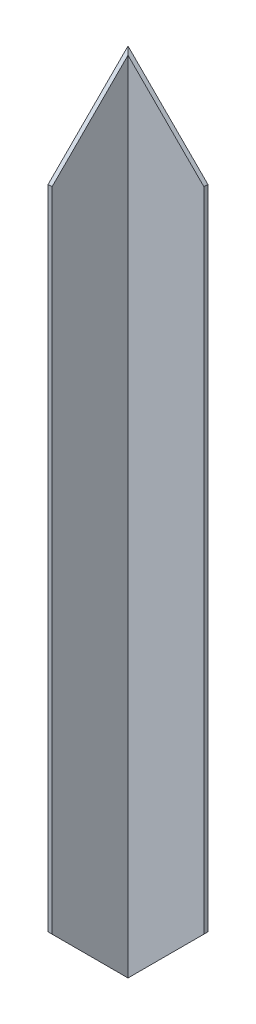
ISO-10303-21;
HEADER;
FILE_DESCRIPTION(('STEP AP214'),'2;1');
FILE_NAME('part.step','',(''),(''),'','','');
FILE_SCHEMA(('AUTOMOTIVE_DESIGN { 1 0 10303 214 1 1 1 1 }'));
ENDSEC;
DATA;
#1=APPLICATION_CONTEXT('core data for automotive mechanical design processes');
#2=APPLICATION_PROTOCOL_DEFINITION('international standard','automotive_design',2000,#1);
#3=PRODUCT_CONTEXT('',#1,'mechanical');
#4=PRODUCT('Part','Part','',(#3));
#5=PRODUCT_RELATED_PRODUCT_CATEGORY('part','',(#4));
#6=PRODUCT_DEFINITION_FORMATION('','',#4);
#7=PRODUCT_DEFINITION_CONTEXT('part definition',#1,'design');
#8=PRODUCT_DEFINITION('design','',#6,#7);
#9=PRODUCT_DEFINITION_SHAPE('','',#8);
#10=(LENGTH_UNIT() NAMED_UNIT(*) SI_UNIT(.MILLI.,.METRE.));
#11=(NAMED_UNIT(*) PLANE_ANGLE_UNIT() SI_UNIT($,.RADIAN.));
#12=(NAMED_UNIT(*) SI_UNIT($,.STERADIAN.) SOLID_ANGLE_UNIT());
#13=UNCERTAINTY_MEASURE_WITH_UNIT(LENGTH_MEASURE(1.E-05),#10,'distance_accuracy_value','');
#14=(GEOMETRIC_REPRESENTATION_CONTEXT(3) GLOBAL_UNCERTAINTY_ASSIGNED_CONTEXT((#13)) GLOBAL_UNIT_ASSIGNED_CONTEXT((#10,
#11,#12)) REPRESENTATION_CONTEXT('',''));
#15=CARTESIAN_POINT('',(0.,0.,0.));
#16=DIRECTION('',(0.,0.,1.));
#17=DIRECTION('',(1.,0.,0.));
#18=AXIS2_PLACEMENT_3D('',#15,#16,#17);
#19=CARTESIAN_POINT('',(-20.,404.,-20.1136363636364));
#20=DIRECTION('',(1.,0.,0.));
#21=DIRECTION('',(0.,0.,-1.));
#22=AXIS2_PLACEMENT_3D('',#19,#20,#21);
#23=PLANE('',#22);
#24=DIRECTION('',(0.,-1.,0.));
#25=VECTOR('',#24,1.);
#26=CARTESIAN_POINT('',(-20.,404.,19.8863636363636));
#27=LINE('',#26,#25);
#28=CARTESIAN_POINT('',(-20.,364.000000000001,19.8863636363636));
#29=VERTEX_POINT('',#28);
#30=CARTESIAN_POINT('',(-20.,39.9999999999995,19.8863636363636));
#31=VERTEX_POINT('',#30);
#32=EDGE_CURVE('E110',#29,#31,#27,.T.);
#33=ORIENTED_EDGE('',*,*,#32,.F.);
#34=DIRECTION('',(0.,-0.707106781186543,0.707106781186552));
#35=VECTOR('',#34,1.);
#36=CARTESIAN_POINT('',(-20.,404.,-20.1136363636364));
#37=LINE('',#36,#35);
#38=CARTESIAN_POINT('',(-20.,404.,-20.1136363636364));
#39=VERTEX_POINT('',#38);
#40=EDGE_CURVE('E128',#39,#29,#37,.T.);
#41=ORIENTED_EDGE('',*,*,#40,.F.);
#42=DIRECTION('',(0.,-1.,0.));
#43=VECTOR('',#42,1.);
#44=CARTESIAN_POINT('',(-20.,404.,-20.1136363636364));
#45=LINE('',#44,#43);
#46=CARTESIAN_POINT('',(-20.,0.,-20.1136363636364));
#47=VERTEX_POINT('',#46);
#48=EDGE_CURVE('E96',#39,#47,#45,.T.);
#49=ORIENTED_EDGE('',*,*,#48,.T.);
#50=DIRECTION('',(0.,-0.707106781186543,-0.707106781186552));
#51=VECTOR('',#50,1.);
#52=CARTESIAN_POINT('',(-20.,0.,-20.1136363636364));
#53=LINE('',#52,#51);
#54=EDGE_CURVE('E127',#31,#47,#53,.T.);
#55=ORIENTED_EDGE('',*,*,#54,.F.);
#56=EDGE_LOOP('',(#33,#41,#49,#55));
#57=FACE_BOUND('',#56,.T.);
#58=ADVANCED_FACE('F33',(#57),#23,.F.);
#59=CARTESIAN_POINT('',(-20.,404.,19.8863636363636));
#60=DIRECTION('',(0.,0.,-1.));
#61=DIRECTION('',(-1.,0.,0.));
#62=AXIS2_PLACEMENT_3D('',#59,#60,#61);
#63=PLANE('',#62);
#64=DIRECTION('',(0.,-1.,0.));
#65=VECTOR('',#64,1.);
#66=CARTESIAN_POINT('',(-18.,404.,19.8863636363636));
#67=LINE('',#66,#65);
#68=CARTESIAN_POINT('',(-18.,364.000000000001,19.8863636363636));
#69=VERTEX_POINT('',#68);
#70=CARTESIAN_POINT('',(-18.,39.9999999999995,19.8863636363636));
#71=VERTEX_POINT('',#70);
#72=EDGE_CURVE('E108',#69,#71,#67,.T.);
#73=ORIENTED_EDGE('',*,*,#72,.F.);
#74=DIRECTION('',(-1.,0.,0.));
#75=VECTOR('',#74,1.);
#76=CARTESIAN_POINT('',(20.,364.000000000001,19.8863636363636));
#77=LINE('',#76,#75);
#78=EDGE_CURVE('E131',#69,#29,#77,.T.);
#79=ORIENTED_EDGE('',*,*,#78,.T.);
#80=ORIENTED_EDGE('',*,*,#32,.T.);
#81=DIRECTION('',(-1.,0.,0.));
#82=VECTOR('',#81,1.);
#83=CARTESIAN_POINT('',(570.,39.9999999999995,19.8863636363635));
#84=LINE('',#83,#82);
#85=EDGE_CURVE('E140',#71,#31,#84,.T.);
#86=ORIENTED_EDGE('',*,*,#85,.F.);
#87=EDGE_LOOP('',(#73,#79,#80,#86));
#88=FACE_BOUND('',#87,.T.);
#89=ADVANCED_FACE('F154',(#88),#63,.F.);
#90=CARTESIAN_POINT('',(-18.,404.,-18.1136363636364));
#91=DIRECTION('',(-1.,0.,0.));
#92=DIRECTION('',(0.,0.,1.));
#93=AXIS2_PLACEMENT_3D('',#90,#91,#92);
#94=PLANE('',#93);
#95=DIRECTION('',(0.,-1.,0.));
#96=VECTOR('',#95,1.);
#97=CARTESIAN_POINT('',(-18.,404.,-18.1136363636364));
#98=LINE('',#97,#96);
#99=CARTESIAN_POINT('',(-18.,402.,-18.1136363636364));
#100=VERTEX_POINT('',#99);
#101=CARTESIAN_POINT('',(-18.,1.99999999999996,-18.1136363636363));
#102=VERTEX_POINT('',#101);
#103=EDGE_CURVE('E101',#100,#102,#98,.T.);
#104=ORIENTED_EDGE('',*,*,#103,.F.);
#105=DIRECTION('',(0.,-0.707106781186543,0.707106781186552));
#106=VECTOR('',#105,1.);
#107=CARTESIAN_POINT('',(-18.,403.,-19.1136363636363));
#108=LINE('',#107,#106);
#109=EDGE_CURVE('E133',#100,#69,#108,.T.);
#110=ORIENTED_EDGE('',*,*,#109,.T.);
#111=ORIENTED_EDGE('',*,*,#72,.T.);
#112=DIRECTION('',(0.,-0.707106781186543,-0.707106781186552));
#113=VECTOR('',#112,1.);
#114=CARTESIAN_POINT('',(-18.,202.999999999998,182.886363636364));
#115=LINE('',#114,#113);
#116=EDGE_CURVE('E121',#71,#102,#115,.T.);
#117=ORIENTED_EDGE('',*,*,#116,.T.);
#118=EDGE_LOOP('',(#104,#110,#111,#117));
#119=FACE_BOUND('',#118,.T.);
#120=ADVANCED_FACE('F149',(#119),#94,.F.);
#121=CARTESIAN_POINT('',(-18.,404.,-18.1136363636364));
#122=DIRECTION('',(0.,0.,-1.));
#123=DIRECTION('',(-1.,0.,0.));
#124=AXIS2_PLACEMENT_3D('',#121,#122,#123);
#125=PLANE('',#124);
#126=DIRECTION('',(0.,-1.,0.));
#127=VECTOR('',#126,1.);
#128=CARTESIAN_POINT('',(20.,404.,-18.1136363636364));
#129=LINE('',#128,#127);
#130=CARTESIAN_POINT('',(20.,364.,-18.1136363636364));
#131=VERTEX_POINT('',#130);
#132=CARTESIAN_POINT('',(20.,40.0000000000001,-18.1136363636364));
#133=VERTEX_POINT('',#132);
#134=EDGE_CURVE('E47',#131,#133,#129,.T.);
#135=ORIENTED_EDGE('',*,*,#134,.F.);
#136=DIRECTION('',(-0.707106781186551,0.707106781186544,0.));
#137=VECTOR('',#136,1.);
#138=CARTESIAN_POINT('',(-19.,403.,-18.1136363636364));
#139=LINE('',#138,#137);
#140=EDGE_CURVE('E91',#131,#100,#139,.T.);
#141=ORIENTED_EDGE('',*,*,#140,.T.);
#142=ORIENTED_EDGE('',*,*,#103,.T.);
#143=DIRECTION('',(0.707106781186547,0.707106781186549,0.));
#144=VECTOR('',#143,1.);
#145=CARTESIAN_POINT('',(183.,203.000000000001,-18.1136363636364));
#146=LINE('',#145,#144);
#147=EDGE_CURVE('E103',#102,#133,#146,.T.);
#148=ORIENTED_EDGE('',*,*,#147,.T.);
#149=EDGE_LOOP('',(#135,#141,#142,#148));
#150=FACE_BOUND('',#149,.T.);
#151=ADVANCED_FACE('F145',(#150),#125,.F.);
#152=CARTESIAN_POINT('',(20.,404.,-20.1136363636364));
#153=DIRECTION('',(-1.,0.,0.));
#154=DIRECTION('',(0.,0.,1.));
#155=AXIS2_PLACEMENT_3D('',#152,#153,#154);
#156=PLANE('',#155);
#157=DIRECTION('',(0.,-1.,0.));
#158=VECTOR('',#157,1.);
#159=CARTESIAN_POINT('',(20.,404.,-20.1136363636364));
#160=LINE('',#159,#158);
#161=CARTESIAN_POINT('',(20.,364.,-20.1136363636364));
#162=VERTEX_POINT('',#161);
#163=CARTESIAN_POINT('',(20.,40.0000000000001,-20.1136363636364));
#164=VERTEX_POINT('',#163);
#165=EDGE_CURVE('E55',#162,#164,#160,.T.);
#166=ORIENTED_EDGE('',*,*,#165,.F.);
#167=DIRECTION('',(0.,0.,-1.));
#168=VECTOR('',#167,1.);
#169=CARTESIAN_POINT('',(20.,364.,19.8863636363636));
#170=LINE('',#169,#168);
#171=EDGE_CURVE('E87',#131,#162,#170,.T.);
#172=ORIENTED_EDGE('',*,*,#171,.F.);
#173=ORIENTED_EDGE('',*,*,#134,.T.);
#174=DIRECTION('',(0.,0.,-1.));
#175=VECTOR('',#174,1.);
#176=CARTESIAN_POINT('',(20.,40.0000000000001,569.886363636364));
#177=LINE('',#176,#175);
#178=EDGE_CURVE('E99',#133,#164,#177,.T.);
#179=ORIENTED_EDGE('',*,*,#178,.T.);
#180=EDGE_LOOP('',(#166,#172,#173,#179));
#181=FACE_BOUND('',#180,.T.);
#182=ADVANCED_FACE('F98',(#181),#156,.F.);
#183=CARTESIAN_POINT('',(-20.,404.,-20.1136363636364));
#184=DIRECTION('',(0.,0.,1.));
#185=DIRECTION('',(1.,0.,0.));
#186=AXIS2_PLACEMENT_3D('',#183,#184,#185);
#187=PLANE('',#186);
#188=ORIENTED_EDGE('',*,*,#48,.F.);
#189=DIRECTION('',(-0.707106781186551,0.707106781186544,0.));
#190=VECTOR('',#189,1.);
#191=CARTESIAN_POINT('',(-20.,404.,-20.1136363636364));
#192=LINE('',#191,#190);
#193=EDGE_CURVE('E89',#162,#39,#192,.T.);
#194=ORIENTED_EDGE('',*,*,#193,.F.);
#195=ORIENTED_EDGE('',*,*,#165,.T.);
#196=DIRECTION('',(0.707106781186546,0.707106781186548,0.));
#197=VECTOR('',#196,1.);
#198=CARTESIAN_POINT('',(-20.,0.,-20.1136363636364));
#199=LINE('',#198,#197);
#200=EDGE_CURVE('E116',#47,#164,#199,.T.);
#201=ORIENTED_EDGE('',*,*,#200,.F.);
#202=EDGE_LOOP('',(#188,#194,#195,#201));
#203=FACE_BOUND('',#202,.T.);
#204=ADVANCED_FACE('F94',(#203),#187,.F.);
#205=CARTESIAN_POINT('',(-20.,0.,569.886363636364));
#206=DIRECTION('',(-0.707106781186549,0.707106781186547,0.));
#207=DIRECTION('',(-0.707106781186547,-0.707106781186549,0.));
#208=AXIS2_PLACEMENT_3D('',#205,#206,#207);
#209=PLANE('',#208);
#210=ORIENTED_EDGE('',*,*,#147,.F.);
#211=DIRECTION('',(-0.577350269189623,-0.577350269189624,-0.577350269189631));
#212=VECTOR('',#211,1.);
#213=CARTESIAN_POINT('',(176.666666666667,196.666666666668,176.553030303034));
#214=LINE('',#213,#212);
#215=EDGE_CURVE('E40',#102,#47,#214,.T.);
#216=ORIENTED_EDGE('',*,*,#215,.T.);
#217=ORIENTED_EDGE('',*,*,#200,.T.);
#218=ORIENTED_EDGE('',*,*,#178,.F.);
#219=EDGE_LOOP('',(#210,#216,#217,#218));
#220=FACE_BOUND('',#219,.T.);
#221=ADVANCED_FACE('F115',(#220),#209,.F.);
#222=CARTESIAN_POINT('',(570.,0.,-20.1136363636365));
#223=DIRECTION('',(0.,0.707106781186552,-0.707106781186543));
#224=DIRECTION('',(0.,0.707106781186543,0.707106781186552));
#225=AXIS2_PLACEMENT_3D('',#222,#223,#224);
#226=PLANE('',#225);
#227=ORIENTED_EDGE('',*,*,#85,.T.);
#228=ORIENTED_EDGE('',*,*,#54,.T.);
#229=ORIENTED_EDGE('',*,*,#215,.F.);
#230=ORIENTED_EDGE('',*,*,#116,.F.);
#231=EDGE_LOOP('',(#227,#228,#229,#230));
#232=FACE_BOUND('',#231,.T.);
#233=ADVANCED_FACE('F152',(#232),#226,.F.);
#234=CARTESIAN_POINT('',(20.,404.,-20.1136363636364));
#235=DIRECTION('',(0.,-0.707106781186552,-0.707106781186543));
#236=DIRECTION('',(0.,0.707106781186543,-0.707106781186552));
#237=AXIS2_PLACEMENT_3D('',#234,#235,#236);
#238=PLANE('',#237);
#239=ORIENTED_EDGE('',*,*,#109,.F.);
#240=DIRECTION('',(-0.577350269189628,0.577350269189622,-0.577350269189628));
#241=VECTOR('',#240,1.);
#242=CARTESIAN_POINT('',(-6.6666666666666,390.666666666667,-6.78030303030293));
#243=LINE('',#242,#241);
#244=EDGE_CURVE('E11',#100,#39,#243,.T.);
#245=ORIENTED_EDGE('',*,*,#244,.T.);
#246=ORIENTED_EDGE('',*,*,#40,.T.);
#247=ORIENTED_EDGE('',*,*,#78,.F.);
#248=EDGE_LOOP('',(#239,#245,#246,#247));
#249=FACE_BOUND('',#248,.T.);
#250=ADVANCED_FACE('F155',(#249),#238,.F.);
#251=CARTESIAN_POINT('',(-20.,404.,19.8863636363636));
#252=DIRECTION('',(-0.707106781186544,-0.707106781186551,0.));
#253=DIRECTION('',(0.707106781186551,-0.707106781186544,0.));
#254=AXIS2_PLACEMENT_3D('',#251,#252,#253);
#255=PLANE('',#254);
#256=ORIENTED_EDGE('',*,*,#171,.T.);
#257=ORIENTED_EDGE('',*,*,#193,.T.);
#258=ORIENTED_EDGE('',*,*,#244,.F.);
#259=ORIENTED_EDGE('',*,*,#140,.F.);
#260=EDGE_LOOP('',(#256,#257,#258,#259));
#261=FACE_BOUND('',#260,.T.);
#262=ADVANCED_FACE('F88',(#261),#255,.F.);
#263=CLOSED_SHELL('',(#58,#89,#120,#151,#182,#204,#221,#233,#250,#262));
#264=MANIFOLD_SOLID_BREP('B2',#263);
#265=ADVANCED_BREP_SHAPE_REPRESENTATION('',(#18,#264),#14);
#266=SHAPE_DEFINITION_REPRESENTATION(#9,#265);
ENDSEC;
END-ISO-10303-21;
